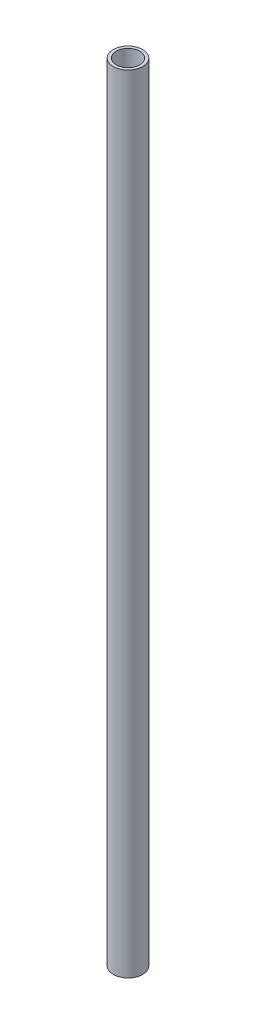
ISO-10303-21;
HEADER;
FILE_DESCRIPTION(('STEP AP214'),'2;1');
FILE_NAME('part.step','',(''),(''),'','','');
FILE_SCHEMA(('AUTOMOTIVE_DESIGN { 1 0 10303 214 1 1 1 1 }'));
ENDSEC;
DATA;
#1=APPLICATION_CONTEXT('core data for automotive mechanical design processes');
#2=APPLICATION_PROTOCOL_DEFINITION('international standard','automotive_design',2000,#1);
#3=PRODUCT_CONTEXT('',#1,'mechanical');
#4=PRODUCT('Part','Part','',(#3));
#5=PRODUCT_RELATED_PRODUCT_CATEGORY('part','',(#4));
#6=PRODUCT_DEFINITION_FORMATION('','',#4);
#7=PRODUCT_DEFINITION_CONTEXT('part definition',#1,'design');
#8=PRODUCT_DEFINITION('design','',#6,#7);
#9=PRODUCT_DEFINITION_SHAPE('','',#8);
#10=(LENGTH_UNIT() NAMED_UNIT(*) SI_UNIT(.MILLI.,.METRE.));
#11=(NAMED_UNIT(*) PLANE_ANGLE_UNIT() SI_UNIT($,.RADIAN.));
#12=(NAMED_UNIT(*) SI_UNIT($,.STERADIAN.) SOLID_ANGLE_UNIT());
#13=UNCERTAINTY_MEASURE_WITH_UNIT(LENGTH_MEASURE(1.E-05),#10,'distance_accuracy_value','');
#14=(GEOMETRIC_REPRESENTATION_CONTEXT(3) GLOBAL_UNCERTAINTY_ASSIGNED_CONTEXT((#13)) GLOBAL_UNIT_ASSIGNED_CONTEXT((#10,
#11,#12)) REPRESENTATION_CONTEXT('',''));
#15=CARTESIAN_POINT('',(0.,0.,0.));
#16=DIRECTION('',(0.,0.,1.));
#17=DIRECTION('',(1.,0.,0.));
#18=AXIS2_PLACEMENT_3D('',#15,#16,#17);
#19=CARTESIAN_POINT('',(0.,254.,0.));
#20=DIRECTION('',(0.,1.,0.));
#21=DIRECTION('',(0.,0.,1.));
#22=AXIS2_PLACEMENT_3D('',#19,#20,#21);
#23=PLANE('',#22);
#24=CARTESIAN_POINT('',(0.,254.,0.));
#25=DIRECTION('',(0.,1.,0.));
#26=DIRECTION('',(0.,0.,1.));
#27=AXIS2_PLACEMENT_3D('',#24,#25,#26);
#28=CIRCLE('',#27,4.7625);
#29=CARTESIAN_POINT('',(0.,254.,4.7625));
#30=VERTEX_POINT('',#29);
#31=EDGE_CURVE('E10',#30,#30,#28,.T.);
#32=ORIENTED_EDGE('',*,*,#31,.T.);
#33=EDGE_LOOP('',(#32));
#34=FACE_BOUND('',#33,.T.);
#35=CARTESIAN_POINT('',(0.,254.,0.));
#36=DIRECTION('',(0.,1.,0.));
#37=DIRECTION('',(0.,0.,1.));
#38=AXIS2_PLACEMENT_3D('',#35,#36,#37);
#39=CIRCLE('',#38,3.81);
#40=CARTESIAN_POINT('',(0.,254.,3.81));
#41=VERTEX_POINT('',#40);
#42=EDGE_CURVE('E42',#41,#41,#39,.T.);
#43=ORIENTED_EDGE('',*,*,#42,.F.);
#44=EDGE_LOOP('',(#43));
#45=FACE_BOUND('',#44,.T.);
#46=ADVANCED_FACE('F31',(#34,#45),#23,.T.);
#47=CARTESIAN_POINT('',(0.,0.,0.));
#48=DIRECTION('',(0.,1.,0.));
#49=DIRECTION('',(0.,0.,1.));
#50=AXIS2_PLACEMENT_3D('',#47,#48,#49);
#51=PLANE('',#50);
#52=CARTESIAN_POINT('',(0.,0.,0.));
#53=DIRECTION('',(0.,1.,0.));
#54=DIRECTION('',(0.,0.,1.));
#55=AXIS2_PLACEMENT_3D('',#52,#53,#54);
#56=CIRCLE('',#55,4.7625);
#57=CARTESIAN_POINT('',(0.,0.,4.7625));
#58=VERTEX_POINT('',#57);
#59=EDGE_CURVE('E35',#58,#58,#56,.T.);
#60=ORIENTED_EDGE('',*,*,#59,.F.);
#61=EDGE_LOOP('',(#60));
#62=FACE_BOUND('',#61,.T.);
#63=CARTESIAN_POINT('',(0.,0.,0.));
#64=DIRECTION('',(0.,1.,0.));
#65=DIRECTION('',(0.,0.,1.));
#66=AXIS2_PLACEMENT_3D('',#63,#64,#65);
#67=CIRCLE('',#66,3.81);
#68=CARTESIAN_POINT('',(0.,0.,3.81));
#69=VERTEX_POINT('',#68);
#70=EDGE_CURVE('E44',#69,#69,#67,.T.);
#71=ORIENTED_EDGE('',*,*,#70,.T.);
#72=EDGE_LOOP('',(#71));
#73=FACE_BOUND('',#72,.T.);
#74=ADVANCED_FACE('F54',(#62,#73),#51,.F.);
#75=CARTESIAN_POINT('',(0.,254.,0.));
#76=DIRECTION('',(0.,-1.,0.));
#77=DIRECTION('',(0.,0.,-1.));
#78=AXIS2_PLACEMENT_3D('',#75,#76,#77);
#79=CYLINDRICAL_SURFACE('',#78,4.7625);
#80=ORIENTED_EDGE('',*,*,#31,.F.);
#81=EDGE_LOOP('',(#80));
#82=FACE_BOUND('',#81,.T.);
#83=ORIENTED_EDGE('',*,*,#59,.T.);
#84=EDGE_LOOP('',(#83));
#85=FACE_BOUND('',#84,.T.);
#86=ADVANCED_FACE('F33',(#82,#85),#79,.T.);
#87=CARTESIAN_POINT('',(0.,254.,0.));
#88=DIRECTION('',(0.,-1.,0.));
#89=DIRECTION('',(0.,0.,-1.));
#90=AXIS2_PLACEMENT_3D('',#87,#88,#89);
#91=CYLINDRICAL_SURFACE('',#90,3.81);
#92=ORIENTED_EDGE('',*,*,#42,.T.);
#93=EDGE_LOOP('',(#92));
#94=FACE_BOUND('',#93,.T.);
#95=ORIENTED_EDGE('',*,*,#70,.F.);
#96=EDGE_LOOP('',(#95));
#97=FACE_BOUND('',#96,.T.);
#98=ADVANCED_FACE('F50',(#94,#97),#91,.F.);
#99=CLOSED_SHELL('',(#46,#74,#86,#98));
#100=MANIFOLD_SOLID_BREP('B2',#99);
#101=ADVANCED_BREP_SHAPE_REPRESENTATION('',(#18,#100),#14);
#102=SHAPE_DEFINITION_REPRESENTATION(#9,#101);
ENDSEC;
END-ISO-10303-21;
